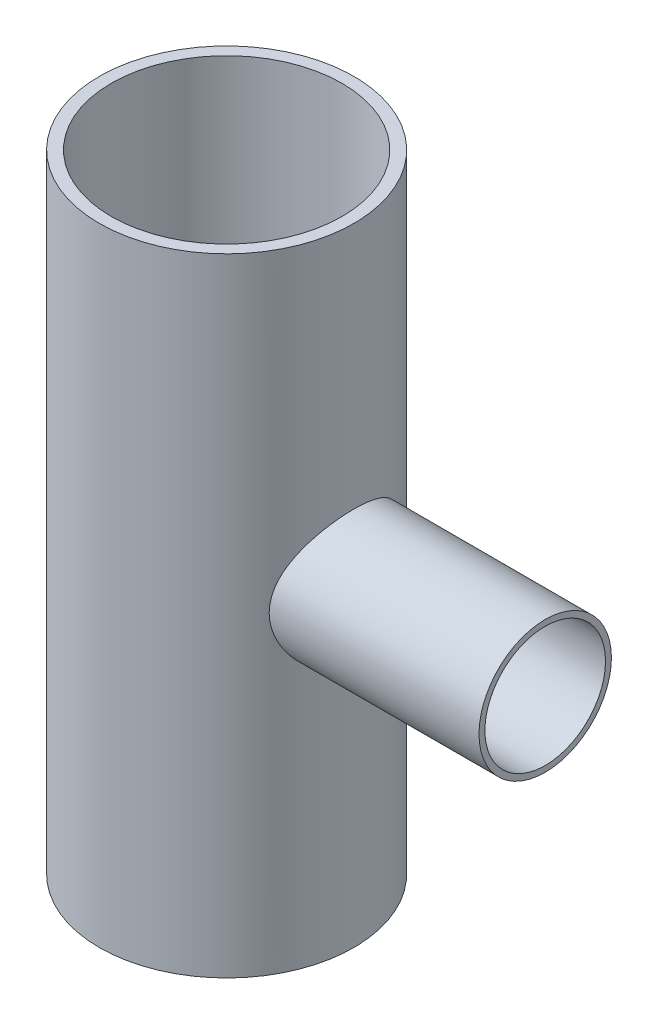
ISO-10303-21;
HEADER;
FILE_DESCRIPTION(('STEP AP214'),'2;1');
FILE_NAME('part.step','',(''),(''),'','','');
FILE_SCHEMA(('AUTOMOTIVE_DESIGN { 1 0 10303 214 1 1 1 1 }'));
ENDSEC;
DATA;
#1=APPLICATION_CONTEXT('core data for automotive mechanical design processes');
#2=APPLICATION_PROTOCOL_DEFINITION('international standard','automotive_design',2000,#1);
#3=PRODUCT_CONTEXT('',#1,'mechanical');
#4=PRODUCT('Part','Part','',(#3));
#5=PRODUCT_RELATED_PRODUCT_CATEGORY('part','',(#4));
#6=PRODUCT_DEFINITION_FORMATION('','',#4);
#7=PRODUCT_DEFINITION_CONTEXT('part definition',#1,'design');
#8=PRODUCT_DEFINITION('design','',#6,#7);
#9=PRODUCT_DEFINITION_SHAPE('','',#8);
#10=(LENGTH_UNIT() NAMED_UNIT(*) SI_UNIT(.MILLI.,.METRE.));
#11=(NAMED_UNIT(*) PLANE_ANGLE_UNIT() SI_UNIT($,.RADIAN.));
#12=(NAMED_UNIT(*) SI_UNIT($,.STERADIAN.) SOLID_ANGLE_UNIT());
#13=UNCERTAINTY_MEASURE_WITH_UNIT(LENGTH_MEASURE(1.E-05),#10,'distance_accuracy_value','');
#14=(GEOMETRIC_REPRESENTATION_CONTEXT(3) GLOBAL_UNCERTAINTY_ASSIGNED_CONTEXT((#13)) GLOBAL_UNIT_ASSIGNED_CONTEXT((#10,
#11,#12)) REPRESENTATION_CONTEXT('',''));
#15=CARTESIAN_POINT('',(0.,0.,0.));
#16=DIRECTION('',(0.,0.,1.));
#17=DIRECTION('',(1.,0.,0.));
#18=AXIS2_PLACEMENT_3D('',#15,#16,#17);
#19=CARTESIAN_POINT('',(0.,797.56,0.));
#20=DIRECTION('',(0.,-1.,0.));
#21=DIRECTION('',(0.,0.,-1.));
#22=AXIS2_PLACEMENT_3D('',#19,#20,#21);
#23=CYLINDRICAL_SURFACE('',#22,161.925);
#24=CARTESIAN_POINT('',(0.,797.56,0.));
#25=DIRECTION('',(0.,1.,0.));
#26=DIRECTION('',(0.,0.,1.));
#27=AXIS2_PLACEMENT_3D('',#24,#25,#26);
#28=CIRCLE('',#27,161.925);
#29=CARTESIAN_POINT('',(0.,797.56,161.925));
#30=VERTEX_POINT('',#29);
#31=EDGE_CURVE('E51',#30,#30,#28,.T.);
#32=ORIENTED_EDGE('',*,*,#31,.F.);
#33=EDGE_LOOP('',(#32));
#34=FACE_BOUND('',#33,.T.);
#35=CARTESIAN_POINT('',(0.,0.,0.));
#36=DIRECTION('',(0.,1.,0.));
#37=DIRECTION('',(0.,0.,1.));
#38=AXIS2_PLACEMENT_3D('',#35,#36,#37);
#39=CIRCLE('',#38,161.925);
#40=CARTESIAN_POINT('',(0.,0.,161.925));
#41=VERTEX_POINT('',#40);
#42=EDGE_CURVE('E56',#41,#41,#39,.T.);
#43=ORIENTED_EDGE('',*,*,#42,.T.);
#44=EDGE_LOOP('',(#43));
#45=FACE_BOUND('',#44,.T.);
#46=CARTESIAN_POINT('',(138.310871676814,398.78,84.201));
#47=CARTESIAN_POINT('',(138.31087186881,397.689646553853,84.2009998537785));
#48=CARTESIAN_POINT('',(138.323775964279,396.59928865279,84.1798140712417));
#49=CARTESIAN_POINT('',(138.375267290814,394.420708113961,84.095145330706));
#50=CARTESIAN_POINT('',(138.41385735769,393.332485725269,84.0316577024505));
#51=CARTESIAN_POINT('',(138.51635740774,391.160190365877,83.8625907099585));
#52=CARTESIAN_POINT('',(138.580274910478,390.076118724104,83.7569988451657));
#53=CARTESIAN_POINT('',(138.732815367061,387.914488252907,83.5040918505789));
#54=CARTESIAN_POINT('',(138.82144100952,386.836930145296,83.356772180149));
#55=CARTESIAN_POINT('',(139.022706725035,384.688832067385,83.0206664036173));
#56=CARTESIAN_POINT('',(139.135383987732,383.618305642723,82.8318160671894));
#57=CARTESIAN_POINT('',(139.383633767535,381.487813920811,82.41339339028));
#58=CARTESIAN_POINT('',(139.519208730308,380.427849764521,82.1838166997488));
#59=CARTESIAN_POINT('',(139.812001070485,378.320607200625,81.6847212547683));
#60=CARTESIAN_POINT('',(139.969214146637,377.273326316725,81.4152104376624));
#61=CARTESIAN_POINT('',(140.303936178817,375.192883673067,80.8370120636385));
#62=CARTESIAN_POINT('',(140.481447180714,374.159723348318,80.5283205572745));
#63=CARTESIAN_POINT('',(141.040069435602,371.095741671188,79.5485316630893));
#64=CARTESIAN_POINT('',(141.449057605781,369.087771653181,78.8207110718189));
#65=CARTESIAN_POINT('',(142.328943044375,365.14478755664,77.2205297815108));
#66=CARTESIAN_POINT('',(142.799841333879,363.209774682071,76.3481666984625));
#67=CARTESIAN_POINT('',(143.790421474751,359.420993100319,74.4657708646467));
#68=CARTESIAN_POINT('',(144.310102833507,357.567223573015,73.4557395040113));
#69=CARTESIAN_POINT('',(145.385007639911,353.948205788891,71.3046330700673));
#70=CARTESIAN_POINT('',(145.940232812097,352.182961834631,70.1635516362543));
#71=CARTESIAN_POINT('',(147.12401794136,348.593323770139,67.6485725269298));
#72=CARTESIAN_POINT('',(147.754689858407,346.777815221342,66.2629737889287));
#73=CARTESIAN_POINT('',(149.026444335379,343.267289450637,63.3509949282846));
#74=CARTESIAN_POINT('',(149.667527388994,341.572277963247,61.8246081133938));
#75=CARTESIAN_POINT('',(150.944661098418,338.309776048933,58.6375628526751));
#76=CARTESIAN_POINT('',(151.580709051132,336.742350412403,56.9768370300339));
#77=CARTESIAN_POINT('',(152.832382931233,333.743884890616,53.5287824181613));
#78=CARTESIAN_POINT('',(153.448008180656,332.312849530099,51.74144943217));
#79=CARTESIAN_POINT('',(154.367333121409,330.224875500059,48.9031807501698));
#80=CARTESIAN_POINT('',(154.683594622065,329.516062236012,47.894045923236));
#81=CARTESIAN_POINT('',(155.303801955514,328.141839348983,45.8430143206209));
#82=CARTESIAN_POINT('',(155.60774895809,327.476425599699,44.8011206735548));
#83=CARTESIAN_POINT('',(156.20125696383,326.190324808721,42.6858287879205));
#84=CARTESIAN_POINT('',(156.490815297487,325.569646057086,41.6124247616131));
#85=CARTESIAN_POINT('',(157.053395912716,324.374692553516,39.4360182623538));
#86=CARTESIAN_POINT('',(157.326420149153,323.800412313085,38.3330193108188));
#87=CARTESIAN_POINT('',(157.853878547534,322.699891571232,36.0995126471926));
#88=CARTESIAN_POINT('',(158.108319932503,322.173632384309,34.9690158535502));
#89=CARTESIAN_POINT('',(158.596810408814,321.170445323243,32.6821697644331));
#90=CARTESIAN_POINT('',(158.830861827899,320.693511816858,31.52582343896));
#91=CARTESIAN_POINT('',(159.276814093483,319.790377383101,29.1893231058037));
#92=CARTESIAN_POINT('',(159.488715635611,319.364174862436,28.0091698471798));
#93=CARTESIAN_POINT('',(159.888718331427,318.563884626372,25.6273584953126));
#94=CARTESIAN_POINT('',(160.076819980188,318.189795826913,24.4257008499861));
#95=CARTESIAN_POINT('',(160.414399881278,317.52140548295,22.0953600270137));
#96=CARTESIAN_POINT('',(160.565726151379,317.223202866546,20.9680619115557));
#97=CARTESIAN_POINT('',(160.845715836432,316.673343226716,18.6993990523158));
#98=CARTESIAN_POINT('',(160.974379787426,316.421685102346,17.558034641933));
#99=CARTESIAN_POINT('',(161.208128076187,315.965740063688,15.2635150887213));
#100=CARTESIAN_POINT('',(161.31321301656,315.761451938764,14.1103602480068));
#101=CARTESIAN_POINT('',(161.499047026338,315.400932879995,11.7946058009136));
#102=CARTESIAN_POINT('',(161.579796037496,315.244702061172,10.6320061719362));
#103=CARTESIAN_POINT('',(161.716326851716,314.980919584599,8.30049036796788));
#104=CARTESIAN_POINT('',(161.772122483534,314.873340964221,7.13157805580016));
#105=CARTESIAN_POINT('',(161.858398689281,314.707120583657,4.78933908223575));
#106=CARTESIAN_POINT('',(161.888879156572,314.648479029613,3.61601240226504));
#107=CARTESIAN_POINT('',(161.924296399848,314.5803480762,1.26761699301569));
#108=CARTESIAN_POINT('',(161.9292346531,314.570855834215,0.0925483684168199));
#109=CARTESIAN_POINT('',(161.913533747122,314.601051507428,-2.2567699104887));
#110=CARTESIAN_POINT('',(161.892895125546,314.640738388825,-3.43101958149153));
#111=CARTESIAN_POINT('',(161.82933653411,314.763100814478,-5.66575878562486));
#112=CARTESIAN_POINT('',(161.788695546622,314.841380561152,-6.72655720757073));
#113=CARTESIAN_POINT('',(161.686797307605,315.037953942532,-8.84354307197344));
#114=CARTESIAN_POINT('',(161.625538286583,315.156251011629,-9.89973011078612));
#115=CARTESIAN_POINT('',(161.482787798532,315.432489516786,-12.0053404095301));
#116=CARTESIAN_POINT('',(161.40129981439,315.590424128373,-13.0547648019308));
#117=CARTESIAN_POINT('',(161.218565626408,315.945515323048,-15.1453224846946));
#118=CARTESIAN_POINT('',(161.117317552159,316.142675619112,-16.1864549804637));
#119=CARTESIAN_POINT('',(160.895673667249,316.575649983692,-18.2585154206624));
#120=CARTESIAN_POINT('',(160.775279163167,316.811461414633,-19.2894440563224));
#121=CARTESIAN_POINT('',(160.516027178746,317.321139918894,-21.3395969012119));
#122=CARTESIAN_POINT('',(160.377167991925,317.595010509701,-22.3588200191625));
#123=CARTESIAN_POINT('',(160.081793260199,318.180079962933,-24.3838441458744));
#124=CARTESIAN_POINT('',(159.925278854286,318.491276417434,-25.3896460158054));
#125=CARTESIAN_POINT('',(159.59546795269,319.150248277006,-27.3864362566262));
#126=CARTESIAN_POINT('',(159.422169916828,319.498027039368,-28.3774232583532));
#127=CARTESIAN_POINT('',(158.873912984126,320.60431219953,-31.3508970282153));
#128=CARTESIAN_POINT('',(158.474320653487,321.418433887293,-33.3085309130363));
#129=CARTESIAN_POINT('',(157.618879942642,323.186270136712,-37.1464975582394));
#130=CARTESIAN_POINT('',(157.16303170301,324.139984349548,-39.0268305117696));
#131=CARTESIAN_POINT('',(156.204462221107,326.180084410531,-42.7022111611805));
#132=CARTESIAN_POINT('',(155.701729635961,327.266502383911,-44.4972380593053));
#133=CARTESIAN_POINT('',(154.659666853484,329.564653611495,-47.9939835200277));
#134=CARTESIAN_POINT('',(154.120334556788,330.776394056308,-49.6956967199974));
#135=CARTESIAN_POINT('',(152.960449154316,333.445569350282,-53.1646213109563));
#136=CARTESIAN_POINT('',(152.337168559108,334.915456391841,-54.9213523133772));
#137=CARTESIAN_POINT('',(151.074006027159,337.990013133623,-58.3062133951811));
#138=CARTESIAN_POINT('',(150.434123109864,339.594690807349,-59.9343358556913));
#139=CARTESIAN_POINT('',(149.152615459248,342.932161659988,-63.0559425217469));
#140=CARTESIAN_POINT('',(148.510989724428,344.66505944623,-64.5493145379725));
#141=CARTESIAN_POINT('',(147.242572095281,348.249919491802,-67.3925407280277));
#142=CARTESIAN_POINT('',(146.615780731517,350.10188600095,-68.7423897746473));
#143=CARTESIAN_POINT('',(145.348977418756,354.056571808043,-71.3840284524782));
#144=CARTESIAN_POINT('',(144.711332256691,356.167728987941,-72.6644133966853));
#145=CARTESIAN_POINT('',(143.798041683591,359.421840839525,-74.4464566608879));
#146=CARTESIAN_POINT('',(143.500754709482,360.521327161896,-75.017478469463));
#147=CARTESIAN_POINT('',(142.923216908793,362.748009752521,-76.1120387746762));
#148=CARTESIAN_POINT('',(142.642964017068,363.875202638375,-76.6355830311091));
#149=CARTESIAN_POINT('',(142.102346366368,366.154782627681,-77.6334375617643));
#150=CARTESIAN_POINT('',(141.841966849175,367.307150201754,-78.1077844663853));
#151=CARTESIAN_POINT('',(141.343491217351,369.635898667445,-79.0062468600813));
#152=CARTESIAN_POINT('',(141.105392425615,370.812276653389,-79.4303683855353));
#153=CARTESIAN_POINT('',(140.65397300271,373.186999772782,-80.2270225936338));
#154=CARTESIAN_POINT('',(140.440651135481,374.385343806945,-80.5995578499656));
#155=CARTESIAN_POINT('',(140.041151683929,376.801681123189,-81.2917043823596));
#156=CARTESIAN_POINT('',(139.854973438001,378.019673925543,-81.6113169483957));
#157=CARTESIAN_POINT('',(139.52577592856,380.373710134882,-82.1727486329981));
#158=CARTESIAN_POINT('',(139.380486460965,381.508436805818,-82.4187637256959));
#159=CARTESIAN_POINT('',(139.116183505046,383.790033687013,-82.8641068866674));
#160=CARTESIAN_POINT('',(138.997169246031,384.936903540061,-83.0634363243087));
#161=CARTESIAN_POINT('',(138.786688842865,387.24036773098,-83.4146423716036));
#162=CARTESIAN_POINT('',(138.695221835766,388.396961763064,-83.5665204677276));
#163=CARTESIAN_POINT('',(138.540836529534,390.717356847519,-83.8222200200366));
#164=CARTESIAN_POINT('',(138.477918284575,391.881157913563,-83.9260413850313));
#165=CARTESIAN_POINT('',(138.381373212845,394.212439285292,-84.085134468038));
#166=CARTESIAN_POINT('',(138.347725151759,395.379916306087,-84.1404413815361));
#167=CARTESIAN_POINT('',(138.310025784331,397.716648132752,-84.2023973345532));
#168=CARTESIAN_POINT('',(138.305974652173,398.885902949044,-84.2090460877103));
#169=CARTESIAN_POINT('',(138.327514639086,401.223312902656,-84.1736581979284));
#170=CARTESIAN_POINT('',(138.353103610477,402.391468113513,-84.1316250824076));
#171=CARTESIAN_POINT('',(138.433629390651,404.723984226939,-83.9990590135457));
#172=CARTESIAN_POINT('',(138.488565384215,405.888345234002,-83.9085274074235));
#173=CARTESIAN_POINT('',(138.618615839169,408.067426363677,-83.6934801151428));
#174=CARTESIAN_POINT('',(138.690408286156,409.08290035035,-83.574529043711));
#175=CARTESIAN_POINT('',(138.855464081713,411.107220560344,-83.3000083536056));
#176=CARTESIAN_POINT('',(138.948729189673,412.116066233593,-83.1444357342752));
#177=CARTESIAN_POINT('',(139.155931190259,414.125168554026,-82.7971816348821));
#178=CARTESIAN_POINT('',(139.269863990733,415.125426860499,-82.6055073025842));
#179=CARTESIAN_POINT('',(139.517502517333,417.116078708295,-82.1865640342925));
#180=CARTESIAN_POINT('',(139.651210073308,418.106471327639,-81.9592918041492));
#181=CARTESIAN_POINT('',(139.937373366362,420.076023595692,-81.4697341068109));
#182=CARTESIAN_POINT('',(140.089832416175,421.05518122607,-81.2074424522082));
#183=CARTESIAN_POINT('',(140.412326221541,423.000755203922,-80.6485475498913));
#184=CARTESIAN_POINT('',(140.582362507299,423.967170433821,-80.3519413146187));
#185=CARTESIAN_POINT('',(141.116998441872,426.845310779473,-79.4117075755721));
#186=CARTESIAN_POINT('',(141.50617619062,428.736276847199,-78.7175787130087));
#187=CARTESIAN_POINT('',(142.358251708214,432.53739112809,-77.1663862898366));
#188=CARTESIAN_POINT('',(142.82369210783,434.444520963437,-76.3033616711874));
#189=CARTESIAN_POINT('',(143.801882528926,438.179659174979,-74.4434540966626));
#190=CARTESIAN_POINT('',(144.314633175381,440.007666505487,-73.4465693723977));
#191=CARTESIAN_POINT('',(145.374939031015,443.578256042013,-71.3248858761564));
#192=CARTESIAN_POINT('',(145.922508201569,445.320803478298,-70.2000356486697));
#193=CARTESIAN_POINT('',(147.039776535762,448.713604436745,-67.8286650679139));
#194=CARTESIAN_POINT('',(147.609477204727,450.363851662199,-66.5821364296454));
#195=CARTESIAN_POINT('',(148.838542958413,453.788281297965,-63.792066117192));
#196=CARTESIAN_POINT('',(149.499391000135,455.547936990746,-62.2313046309397));
#197=CARTESIAN_POINT('',(150.816711687656,458.931576511666,-58.9671316889793));
#198=CARTESIAN_POINT('',(151.473183968195,460.555549141194,-57.2637084818647));
#199=CARTESIAN_POINT('',(152.765347315859,463.659474534588,-53.7215994787458));
#200=CARTESIAN_POINT('',(153.401029203296,465.139364235987,-51.8828550678549));
#201=CARTESIAN_POINT('',(154.63539155637,467.944979032752,-48.0790676107398));
#202=CARTESIAN_POINT('',(155.234072187781,469.270704818827,-46.1140251304362));
#203=CARTESIAN_POINT('',(156.102796134665,471.157561339698,-43.0442670446697));
#204=CARTESIAN_POINT('',(156.392095651105,471.779106847673,-41.9816463272315));
#205=CARTESIAN_POINT('',(156.954641226439,472.976642465159,-39.8269411703438));
#206=CARTESIAN_POINT('',(157.227888995845,473.552637430914,-38.7348598884437));
#207=CARTESIAN_POINT('',(157.756424143221,474.657714801283,-36.5227309341054));
#208=CARTESIAN_POINT('',(158.011708421751,475.186789114235,-35.4026784804408));
#209=CARTESIAN_POINT('',(158.502373404332,476.196405164801,-33.1367882948195));
#210=CARTESIAN_POINT('',(158.737756535501,476.676952822059,-31.990953728861));
#211=CARTESIAN_POINT('',(159.186744317134,477.587863142383,-29.6761708852834));
#212=CARTESIAN_POINT('',(159.400362647547,478.018257353429,-28.5072376846021));
#213=CARTESIAN_POINT('',(159.804326580498,478.827789521906,-26.1479439074529));
#214=CARTESIAN_POINT('',(159.994674956901,479.206933589115,-24.9575859043465));
#215=CARTESIAN_POINT('',(160.350623677809,479.912719360852,-22.5578025788232));
#216=CARTESIAN_POINT('',(160.516225054908,480.239363256045,-21.3483780543054));
#217=CARTESIAN_POINT('',(160.821353313364,480.83898548679,-18.9130579412217));
#218=CARTESIAN_POINT('',(160.960880880178,481.111965233133,-17.687162786562));
#219=CARTESIAN_POINT('',(161.20059860306,481.579589571587,-15.3403685565797));
#220=CARTESIAN_POINT('',(161.303282310175,481.779244850089,-14.2207195105913));
#221=CARTESIAN_POINT('',(161.485721493597,482.133248610726,-11.9724384390076));
#222=CARTESIAN_POINT('',(161.565477498658,482.287598137694,-10.8438066211879));
#223=CARTESIAN_POINT('',(161.701507165652,482.550477167928,-8.57986774928416));
#224=CARTESIAN_POINT('',(161.757782016301,482.659008990683,-7.44456103606296));
#225=CARTESIAN_POINT('',(161.846462318263,482.829898751089,-5.16954014695711));
#226=CARTESIAN_POINT('',(161.878867668488,482.892256493192,-4.0298259524273));
#227=CARTESIAN_POINT('',(161.919573176509,482.970569975703,-1.7487730826127));
#228=CARTESIAN_POINT('',(161.927881765289,482.986541945585,-0.60743511532373));
#229=CARTESIAN_POINT('',(161.920359054581,482.972074990911,1.67487030078295));
#230=CARTESIAN_POINT('',(161.904527692772,482.941635946538,2.81583774863651));
#231=CARTESIAN_POINT('',(161.848837777943,482.834453526536,5.09496792383115));
#232=CARTESIAN_POINT('',(161.808979987729,482.757711620961,6.23313073906376));
#233=CARTESIAN_POINT('',(161.705517635,482.558186266673,8.50431571257097));
#234=CARTESIAN_POINT('',(161.641913429389,482.435403509947,9.63733794784887));
#235=CARTESIAN_POINT('',(161.497051948433,482.155139039076,11.8111759632084));
#236=CARTESIAN_POINT('',(161.417477499765,482.00095249518,12.8525309087634));
#237=CARTESIAN_POINT('',(161.238855356961,481.653960842199,14.9271985257328));
#238=CARTESIAN_POINT('',(161.139805990259,481.461152416119,15.9605104984618));
#239=CARTESIAN_POINT('',(160.922831996758,481.037484328451,18.0171249823951));
#240=CARTESIAN_POINT('',(160.804910392818,480.806630760563,19.040429068804));
#241=CARTESIAN_POINT('',(160.550845802398,480.307437191892,21.0756582306968));
#242=CARTESIAN_POINT('',(160.414701148898,480.03909376149,22.0875822559567));
#243=CARTESIAN_POINT('',(160.124965033654,479.465615013228,24.0983994311794));
#244=CARTESIAN_POINT('',(159.971374095733,479.160480799994,25.0972929713781));
#245=CARTESIAN_POINT('',(159.647594228899,478.514153187263,27.0806486054761));
#246=CARTESIAN_POINT('',(159.477403853605,478.172956645283,28.0651094331779));
#247=CARTESIAN_POINT('',(158.943306456248,477.096453851217,30.9946518997145));
#248=CARTESIAN_POINT('',(158.555815577708,476.308121242792,32.9162894416712));
#249=CARTESIAN_POINT('',(157.709620754381,474.562798780367,36.7615577833963));
#250=CARTESIAN_POINT('',(157.24868870965,473.600325116924,38.6821953430653));
#251=CARTESIAN_POINT('',(156.27774318207,471.537568209779,42.4349976880403));
#252=CARTESIAN_POINT('',(155.767728906221,470.437282739428,44.2671610431913));
#253=CARTESIAN_POINT('',(154.709197271963,468.106165910358,47.8355034784144));
#254=CARTESIAN_POINT('',(154.160666752995,466.875289856207,49.5716493846355));
#255=CARTESIAN_POINT('',(153.036419796819,464.290327872561,52.940654829298));
#256=CARTESIAN_POINT('',(152.460701861136,462.936235147974,54.573508663012));
#257=CARTESIAN_POINT('',(151.554675425538,460.743118623925,57.024144035475));
#258=CARTESIAN_POINT('',(151.229630873027,459.944233839097,57.8801755438129));
#259=CARTESIAN_POINT('',(150.576885065102,458.312013686271,59.5576779673953));
#260=CARTESIAN_POINT('',(150.249183943503,457.478680044952,60.3791506106779));
#261=CARTESIAN_POINT('',(149.593211365436,455.778654101523,61.9865327952649));
#262=CARTESIAN_POINT('',(149.264939925086,454.91196272801,62.7724433252095));
#263=CARTESIAN_POINT('',(148.609877630591,453.146082674797,64.3079075018675));
#264=CARTESIAN_POINT('',(148.283087173873,452.246885793187,65.0574518592053));
#265=CARTESIAN_POINT('',(147.307712506436,449.500763451465,67.2510588808062));
#266=CARTESIAN_POINT('',(146.664591550281,447.606502602193,68.6389642099641));
#267=CARTESIAN_POINT('',(145.411079569549,443.701077441722,71.2560851662953));
#268=CARTESIAN_POINT('',(144.800687021113,441.689918582487,72.4853081855963));
#269=CARTESIAN_POINT('',(143.91044288665,438.546683739172,74.2289811442177));
#270=CARTESIAN_POINT('',(143.611920106369,437.45335624621,74.8044850741795));
#271=CARTESIAN_POINT('',(143.031531301988,435.239055797258,75.9083354314264));
#272=CARTESIAN_POINT('',(142.749661494907,434.118089202564,76.4366925828619));
#273=CARTESIAN_POINT('',(142.205093768045,431.849685581848,77.4451125573748));
#274=CARTESIAN_POINT('',(141.942401248916,430.702241218053,77.9251617904126));
#275=CARTESIAN_POINT('',(141.438859602608,428.382957731504,78.835431147396));
#276=CARTESIAN_POINT('',(141.198011521718,427.211117443555,79.2656488848253));
#277=CARTESIAN_POINT('',(140.741355934131,424.848589317343,80.0736607035432));
#278=CARTESIAN_POINT('',(140.525478150068,423.657965651007,80.4516025306257));
#279=CARTESIAN_POINT('',(140.120335302613,421.256904346687,81.155172981744));
#280=CARTESIAN_POINT('',(139.931069630666,420.046467162496,81.4808028020539));
#281=CARTESIAN_POINT('',(139.581426562298,417.609001814971,82.0783209788365));
#282=CARTESIAN_POINT('',(139.421032954941,416.381983380304,82.3502395012483));
#283=CARTESIAN_POINT('',(139.130958189318,413.913668049342,82.8393810248806));
#284=CARTESIAN_POINT('',(139.001272044486,412.672373505711,83.0566129069921));
#285=CARTESIAN_POINT('',(138.792762406399,410.382287878981,83.4044885143992));
#286=CARTESIAN_POINT('',(138.709090008076,409.335196602561,83.5434816882833));
#287=CARTESIAN_POINT('',(138.565114642111,407.235212875633,83.7820630907619));
#288=CARTESIAN_POINT('',(138.504805159132,406.182322125647,83.8816623055156));
#289=CARTESIAN_POINT('',(138.40807652972,404.072367678831,84.0411725168395));
#290=CARTESIAN_POINT('',(138.371659097251,403.015303688094,84.1010806660641));
#291=CARTESIAN_POINT('',(138.323053335844,400.898828234984,84.1809998166287));
#292=CARTESIAN_POINT('',(138.310871490265,399.839416220341,84.2010001420727));
#293=CARTESIAN_POINT('',(138.310871676814,398.78,84.201));
#294=B_SPLINE_CURVE_WITH_KNOTS('',3,(#46,#47,#48,#49,#50,#51,#52,#53,#54,#55,#56,#57,#58,#59,
#60,#61,#62,#63,#64,#65,#66,#67,#68,#69,#70,#71,#72,#73,#74,#75,#76,#77,#78,#79,#80,#81,#82,#83,
#84,#85,#86,#87,#88,#89,#90,#91,#92,#93,#94,#95,#96,#97,#98,#99,#100,#101,#102,#103,#104,#105,
#106,#107,#108,#109,#110,#111,#112,#113,#114,#115,#116,#117,#118,#119,#120,#121,#122,#123,#124,
#125,#126,#127,#128,#129,#130,#131,#132,#133,#134,#135,#136,#137,#138,#139,#140,#141,#142,#143,
#144,#145,#146,#147,#148,#149,#150,#151,#152,#153,#154,#155,#156,#157,#158,#159,#160,#161,#162,
#163,#164,#165,#166,#167,#168,#169,#170,#171,#172,#173,#174,#175,#176,#177,#178,#179,#180,#181,
#182,#183,#184,#185,#186,#187,#188,#189,#190,#191,#192,#193,#194,#195,#196,#197,#198,#199,#200,
#201,#202,#203,#204,#205,#206,#207,#208,#209,#210,#211,#212,#213,#214,#215,#216,#217,#218,#219,
#220,#221,#222,#223,#224,#225,#226,#227,#228,#229,#230,#231,#232,#233,#234,#235,#236,#237,#238,
#239,#240,#241,#242,#243,#244,#245,#246,#247,#248,#249,#250,#251,#252,#253,#254,#255,#256,#257,
#258,#259,#260,#261,#262,#263,#264,#265,#266,#267,#268,#269,#270,#271,#272,#273,#274,#275,#276,
#277,#278,#279,#280,#281,#282,#283,#284,#285,#286,#287,#288,#289,#290,#291,#292,#293),
.UNSPECIFIED.,.T.,.F.,(4,2,2,2,2,2,2,2,2,2,2,2,2,2,2,2,2,2,2,2,2,2,2,2,2,2,2,2,2,2,2,2,2,2,2,2,
2,2,2,2,2,2,2,2,2,2,2,2,2,2,2,2,2,2,2,2,2,2,2,2,2,2,2,2,2,2,2,2,2,2,2,2,2,2,2,2,2,2,2,2,2,2,2,2,
2,2,2,2,2,2,2,2,2,2,2,2,2,2,2,2,2,2,2,2,2,2,2,2,2,2,2,2,2,2,2,2,2,2,2,2,2,2,2,4),(0.,
3.27078668202436,6.54193452900983,9.81405428888919,13.0865302433006,16.3641033760048,
19.6420268027619,22.919299578265,26.1969029683366,32.7128638400211,39.2289321933676,
45.7449347543234,52.2612537026731,59.3617832047334,66.462650398858,73.5671013324855,
80.6717878739515,84.4900694125458,88.307987389111,92.1266110730303,95.9447823871678,
99.7614616178202,103.577704559452,107.393827613825,111.209871274135,114.736231794623,
118.262508893475,121.78869586136,125.314891268892,128.83913008747,132.363383751357,
135.887433583044,139.411409336421,142.603838712587,145.796542141003,148.988696252005,
152.181152665759,155.373391315084,158.565925192437,161.758253227272,164.950874489673,
171.415884734457,177.880878824454,184.347441088453,190.8143745895,197.928309013166,
205.042664556428,212.16288968229,219.283369085441,226.922889650326,230.744118875053,
234.564883900965,238.382783399969,242.20022357486,246.017473225409,249.834629817989,
253.343812269969,256.852891778918,260.3618613507,263.870837580915,267.377266064978,
270.883715184984,274.389910248626,277.89600792022,280.969926068817,284.044096172525,
287.117658261026,290.191504938266,293.265895438659,296.340553808958,302.488791982055,
308.915823885964,315.342940703985,321.772651091032,328.202799578425,335.524223538337,
342.846251176726,350.171469260377,357.49665452324,361.289359109979,365.081658801492,
368.874611224239,372.667100393939,376.457190950584,380.246829272825,384.036309424399,
387.825689940014,391.250367674487,394.674966423491,398.099391783773,401.523831646429,
404.947073220126,408.370323631425,411.793465364776,415.21655565076,418.382779136909,
421.549274667132,424.715263511097,427.88154217368,431.047725794113,434.214185544766,
440.545861226071,447.130735088734,453.715715358001,460.302956692507,466.890561517312,
470.535261037882,474.179778096334,477.824193773514,481.469535531205,488.765337966493,
496.060800408116,499.873003338419,503.684336911137,507.496739712684,511.309325021356,
515.11090458231,518.912397196141,522.711748664426,526.510482734671,529.688274657752,
532.865179734569,536.042312690567,539.220295459785),.UNSPECIFIED.);
#295=CARTESIAN_POINT('',(138.310871676814,398.78,84.201));
#296=VERTEX_POINT('',#295);
#297=EDGE_CURVE('E10',#296,#296,#294,.T.);
#298=ORIENTED_EDGE('',*,*,#297,.F.);
#299=EDGE_LOOP('',(#298));
#300=FACE_BOUND('',#299,.T.);
#301=ADVANCED_FACE('F37',(#34,#45,#300),#23,.T.);
#302=CARTESIAN_POINT('',(0.,797.56,0.));
#303=DIRECTION('',(0.,1.,0.));
#304=DIRECTION('',(0.,0.,1.));
#305=AXIS2_PLACEMENT_3D('',#302,#303,#304);
#306=PLANE('',#305);
#307=CARTESIAN_POINT('',(0.,797.56,0.));
#308=DIRECTION('',(0.,-1.,0.));
#309=DIRECTION('',(0.,0.,-1.));
#310=AXIS2_PLACEMENT_3D('',#307,#308,#309);
#311=CIRCLE('',#310,146.7485);
#312=CARTESIAN_POINT('',(0.,797.56,-146.7485));
#313=VERTEX_POINT('',#312);
#314=EDGE_CURVE('E93',#313,#313,#311,.T.);
#315=ORIENTED_EDGE('',*,*,#314,.T.);
#316=EDGE_LOOP('',(#315));
#317=FACE_BOUND('',#316,.T.);
#318=ORIENTED_EDGE('',*,*,#31,.T.);
#319=EDGE_LOOP('',(#318));
#320=FACE_BOUND('',#319,.T.);
#321=ADVANCED_FACE('F71',(#317,#320),#306,.T.);
#322=CARTESIAN_POINT('',(0.,0.,0.));
#323=DIRECTION('',(0.,1.,0.));
#324=DIRECTION('',(0.,0.,1.));
#325=AXIS2_PLACEMENT_3D('',#322,#323,#324);
#326=PLANE('',#325);
#327=CARTESIAN_POINT('',(0.,0.,0.));
#328=DIRECTION('',(0.,-1.,0.));
#329=DIRECTION('',(0.,0.,-1.));
#330=AXIS2_PLACEMENT_3D('',#327,#328,#329);
#331=CIRCLE('',#330,146.7485);
#332=CARTESIAN_POINT('',(0.,0.,-146.7485));
#333=VERTEX_POINT('',#332);
#334=EDGE_CURVE('E99',#333,#333,#331,.T.);
#335=ORIENTED_EDGE('',*,*,#334,.F.);
#336=EDGE_LOOP('',(#335));
#337=FACE_BOUND('',#336,.T.);
#338=ORIENTED_EDGE('',*,*,#42,.F.);
#339=EDGE_LOOP('',(#338));
#340=FACE_BOUND('',#339,.T.);
#341=ADVANCED_FACE('F69',(#337,#340),#326,.F.);
#342=CARTESIAN_POINT('',(405.13,398.78,0.));
#343=DIRECTION('',(-1.,0.,0.));
#344=DIRECTION('',(0.,0.,1.));
#345=AXIS2_PLACEMENT_3D('',#342,#343,#344);
#346=CYLINDRICAL_SURFACE('',#345,84.201);
#347=CARTESIAN_POINT('',(405.13,398.78,0.));
#348=DIRECTION('',(1.,0.,0.));
#349=DIRECTION('',(0.,0.,-1.));
#350=AXIS2_PLACEMENT_3D('',#347,#348,#349);
#351=CIRCLE('',#350,84.201);
#352=CARTESIAN_POINT('',(405.13,398.78,-84.201));
#353=VERTEX_POINT('',#352);
#354=EDGE_CURVE('E90',#353,#353,#351,.T.);
#355=ORIENTED_EDGE('',*,*,#354,.F.);
#356=EDGE_LOOP('',(#355));
#357=FACE_BOUND('',#356,.T.);
#358=ORIENTED_EDGE('',*,*,#297,.T.);
#359=EDGE_LOOP('',(#358));
#360=FACE_BOUND('',#359,.T.);
#361=ADVANCED_FACE('F63',(#357,#360),#346,.T.);
#362=CARTESIAN_POINT('',(405.13,398.78,0.));
#363=DIRECTION('',(1.,0.,0.));
#364=DIRECTION('',(0.,0.,-1.));
#365=AXIS2_PLACEMENT_3D('',#362,#363,#364);
#366=PLANE('',#365);
#367=CARTESIAN_POINT('',(405.13,398.78,0.));
#368=DIRECTION('',(1.,0.,0.));
#369=DIRECTION('',(0.,0.,-1.));
#370=AXIS2_PLACEMENT_3D('',#367,#368,#369);
#371=CIRCLE('',#370,76.6953);
#372=CARTESIAN_POINT('',(405.13,398.78,-76.6953));
#373=VERTEX_POINT('',#372);
#374=EDGE_CURVE('E105',#373,#373,#371,.T.);
#375=ORIENTED_EDGE('',*,*,#374,.F.);
#376=EDGE_LOOP('',(#375));
#377=FACE_BOUND('',#376,.T.);
#378=ORIENTED_EDGE('',*,*,#354,.T.);
#379=EDGE_LOOP('',(#378));
#380=FACE_BOUND('',#379,.T.);
#381=ADVANCED_FACE('F68',(#377,#380),#366,.T.);
#382=CARTESIAN_POINT('',(0.,797.56,0.));
#383=DIRECTION('',(0.,-1.,0.));
#384=DIRECTION('',(0.,0.,-1.));
#385=AXIS2_PLACEMENT_3D('',#382,#383,#384);
#386=CYLINDRICAL_SURFACE('',#385,146.7485);
#387=CARTESIAN_POINT('',(125.111762876877,398.78,-76.6953));
#388=CARTESIAN_POINT('',(125.111762928609,399.772295587023,-76.6952999645415));
#389=CARTESIAN_POINT('',(125.123578005198,400.764592435153,-76.6760361795435));
#390=CARTESIAN_POINT('',(125.170723031049,402.747238424881,-76.5990494599259));
#391=CARTESIAN_POINT('',(125.206055533083,403.737587343329,-76.5413223501859));
#392=CARTESIAN_POINT('',(125.299901377919,405.714494364595,-76.3875976129726));
#393=CARTESIAN_POINT('',(125.358421456935,406.701051281633,-76.2915888642666));
#394=CARTESIAN_POINT('',(125.498077865254,408.66822752329,-76.0616380684884));
#395=CARTESIAN_POINT('',(125.57921665828,409.648846189195,-75.9276918890927));
#396=CARTESIAN_POINT('',(125.763473361906,411.603662927013,-75.6221058093696));
#397=CARTESIAN_POINT('',(125.866624844196,412.577848821937,-75.4504083220228));
#398=CARTESIAN_POINT('',(126.093880613528,414.516596659442,-75.0699979307181));
#399=CARTESIAN_POINT('',(126.217987142342,415.481157560636,-74.8612810663051));
#400=CARTESIAN_POINT('',(126.486003521483,417.398724329813,-74.4075439162883));
#401=CARTESIAN_POINT('',(126.629909474179,418.351732431953,-74.1625307750894));
#402=CARTESIAN_POINT('',(126.936289346361,420.244889550919,-73.6369002951099));
#403=CARTESIAN_POINT('',(127.098765139543,421.185037259397,-73.3562793631888));
#404=CARTESIAN_POINT('',(127.610038251434,423.973073048891,-72.4656356268137));
#405=CARTESIAN_POINT('',(127.984331167441,425.800157474609,-71.8040740035288));
#406=CARTESIAN_POINT('',(128.789521526121,429.387948398149,-70.349637105055));
#407=CARTESIAN_POINT('',(129.220419869151,431.148653839584,-69.556759741127));
#408=CARTESIAN_POINT('',(130.126814986513,434.596208018742,-67.8459359446676));
#409=CARTESIAN_POINT('',(130.602311646676,436.283056945516,-66.9279898323011));
#410=CARTESIAN_POINT('',(131.585797484785,439.576315525561,-64.9730504936296));
#411=CARTESIAN_POINT('',(132.093788254949,441.18272123021,-63.9360514317236));
#412=CARTESIAN_POINT('',(133.177364302527,444.451051560784,-61.6494437015444));
#413=CARTESIAN_POINT('',(133.754903337326,446.104815103557,-60.3890841259385));
#414=CARTESIAN_POINT('',(134.919546482165,449.302755868865,-57.7402053122674));
#415=CARTESIAN_POINT('',(135.506651049118,450.846927837612,-56.3516799373021));
#416=CARTESIAN_POINT('',(136.676308813929,453.819331548897,-53.4523517285595));
#417=CARTESIAN_POINT('',(137.258859541391,455.247503840307,-51.9414869767397));
#418=CARTESIAN_POINT('',(138.405340443902,457.979856780097,-48.804420411003));
#419=CARTESIAN_POINT('',(138.969269991313,459.284033251893,-47.1782147152465));
#420=CARTESIAN_POINT('',(139.811749069129,461.187755506942,-44.5948591542731));
#421=CARTESIAN_POINT('',(140.101755759279,461.834427373302,-43.6757837161463));
#422=CARTESIAN_POINT('',(140.670503360016,463.088238468352,-41.8077089484317));
#423=CARTESIAN_POINT('',(140.949245340396,463.69538145441,-40.8587124757138));
#424=CARTESIAN_POINT('',(141.493565859938,464.868926711829,-38.9319349106069));
#425=CARTESIAN_POINT('',(141.759141942369,465.435321388464,-37.9541484999227));
#426=CARTESIAN_POINT('',(142.275158627428,466.525835822083,-35.9715243672063));
#427=CARTESIAN_POINT('',(142.525601023141,467.049960589807,-34.9666898703879));
#428=CARTESIAN_POINT('',(143.009465102771,468.054436413176,-32.931874338675));
#429=CARTESIAN_POINT('',(143.242893476332,468.534804691939,-31.9019034019848));
#430=CARTESIAN_POINT('',(143.691076795555,469.4505863716,-29.8183178633066));
#431=CARTESIAN_POINT('',(143.905833880396,469.886004923489,-28.7647059873224));
#432=CARTESIAN_POINT('',(144.315060341043,470.710602366867,-26.6357014411474));
#433=CARTESIAN_POINT('',(144.509530371331,471.099782750104,-25.5603094749422));
#434=CARTESIAN_POINT('',(144.876667575449,471.830636254079,-23.3898432001147));
#435=CARTESIAN_POINT('',(145.049335208076,472.172310374527,-22.2947693062214));
#436=CARTESIAN_POINT('',(145.359155500572,472.782666063067,-20.1717446710138));
#437=CARTESIAN_POINT('',(145.498014984346,473.054932961651,-19.1450723269255));
#438=CARTESIAN_POINT('',(145.754995985789,473.55708332303,-17.0788508431723));
#439=CARTESIAN_POINT('',(145.873117851188,473.786967496507,-16.0393019197367));
#440=CARTESIAN_POINT('',(146.087780211005,474.203591754724,-13.9494128197347));
#441=CARTESIAN_POINT('',(146.184321336883,474.390333101844,-12.8990729598559));
#442=CARTESIAN_POINT('',(146.355127719362,474.72004272577,-10.7897377926675));
#443=CARTESIAN_POINT('',(146.429392922276,474.86301089708,-9.7307424645037));
#444=CARTESIAN_POINT('',(146.555066367962,475.10460224922,-7.60695126235324));
#445=CARTESIAN_POINT('',(146.606487304562,475.203250057805,-6.54215894339201));
#446=CARTESIAN_POINT('',(146.686150915259,475.355961682984,-4.40852026191594));
#447=CARTESIAN_POINT('',(146.714393721436,475.410025753638,-3.33967392253776));
#448=CARTESIAN_POINT('',(146.74748996141,475.473372115193,-1.20035188335691));
#449=CARTESIAN_POINT('',(146.752344649454,475.4826568075,-0.129876274007752));
#450=CARTESIAN_POINT('',(146.738630998963,475.456415905888,2.01036077093598));
#451=CARTESIAN_POINT('',(146.720063158937,475.420891265662,3.0801222212454));
#452=CARTESIAN_POINT('',(146.662517373389,475.310665335643,5.11504286768073));
#453=CARTESIAN_POINT('',(146.62564618446,475.240006863,6.08048376664628));
#454=CARTESIAN_POINT('',(146.533059290389,475.062304744005,8.00718507211638));
#455=CARTESIAN_POINT('',(146.477342103734,474.955258237129,8.9684451439405));
#456=CARTESIAN_POINT('',(146.347411392806,474.705114608142,10.8848354090329));
#457=CARTESIAN_POINT('',(146.273201001272,474.562023591906,11.839966612447));
#458=CARTESIAN_POINT('',(146.106716431833,474.240177124517,13.742701169262));
#459=CARTESIAN_POINT('',(146.014440543286,474.061418295903,14.6903038009242));
#460=CARTESIAN_POINT('',(145.81237667628,473.668746540918,16.5762559976945));
#461=CARTESIAN_POINT('',(145.702589891826,473.454836011382,17.5146061890635));
#462=CARTESIAN_POINT('',(145.466142820633,472.99243029675,19.3806252064049));
#463=CARTESIAN_POINT('',(145.339480973604,472.743931913523,20.308293036045));
#464=CARTESIAN_POINT('',(144.935250048347,471.947506545617,23.072962364147));
#465=CARTESIAN_POINT('',(144.63339025057,471.34856188857,24.8920485038473));
#466=CARTESIAN_POINT('',(143.967517330285,470.012241510516,28.4933964132372));
#467=CARTESIAN_POINT('',(143.602769557164,469.273217908307,30.2749062431874));
#468=CARTESIAN_POINT('',(142.82173234635,467.668210015335,33.7679990495142));
#469=CARTESIAN_POINT('',(142.40544304694,466.802226065199,35.4795822134842));
#470=CARTESIAN_POINT('',(141.529919510138,464.949715828256,38.8251881574171));
#471=CARTESIAN_POINT('',(141.070674991304,463.963160665008,40.4591922268062));
#472=CARTESIAN_POINT('',(140.118582577169,461.876166318193,43.6424750405722));
#473=CARTESIAN_POINT('',(139.625732745714,460.775720570984,45.1917488939778));
#474=CARTESIAN_POINT('',(138.565252586144,458.350814578016,48.3512367417379));
#475=CARTESIAN_POINT('',(137.995090948811,457.014955003505,49.9518631964556));
#476=CARTESIAN_POINT('',(136.839300090538,454.220590551981,53.0362259746375));
#477=CARTESIAN_POINT('',(136.253669951649,452.762078385125,54.5199553401699));
#478=CARTESIAN_POINT('',(135.080488120511,449.728434321096,57.3650913544329));
#479=CARTESIAN_POINT('',(134.492935229277,448.153205723323,58.7263944575234));
#480=CARTESIAN_POINT('',(133.331043592834,444.894336875067,61.3186195037421));
#481=CARTESIAN_POINT('',(132.756705330918,443.210692668083,62.5495366842495));
#482=CARTESIAN_POINT('',(131.594761454243,439.613013908262,64.960463497952));
#483=CARTESIAN_POINT('',(131.009330572514,437.691153141026,66.1299283123193));
#484=CARTESIAN_POINT('',(130.1704600575,434.728484254144,67.7580014295311));
#485=CARTESIAN_POINT('',(129.897333648681,433.727414281502,68.2797602156614));
#486=CARTESIAN_POINT('',(129.366603125926,431.699927432429,69.2800453132862));
#487=CARTESIAN_POINT('',(129.108997127969,430.673513653892,69.7585768756662));
#488=CARTESIAN_POINT('',(128.611932147079,428.597624289491,70.6708061701979));
#489=CARTESIAN_POINT('',(128.372459623917,427.548166681074,71.1045374445274));
#490=CARTESIAN_POINT('',(127.913867482415,425.427251940925,71.9262548603059));
#491=CARTESIAN_POINT('',(127.694745413999,424.355797476501,72.3142465100596));
#492=CARTESIAN_POINT('',(127.279155539658,422.192745329105,73.0432398543044));
#493=CARTESIAN_POINT('',(127.0826865859,421.101148669992,73.3842439298283));
#494=CARTESIAN_POINT('',(126.714588627176,418.89991711475,74.0180359148884));
#495=CARTESIAN_POINT('',(126.542959012991,417.790282661765,74.3108250069879));
#496=CARTESIAN_POINT('',(126.23933576432,415.645665913422,74.8253580404902));
#497=CARTESIAN_POINT('',(126.105260103419,414.611895663453,75.0509308102443));
#498=CARTESIAN_POINT('',(125.861184898052,412.533177701789,75.4595326211651));
#499=CARTESIAN_POINT('',(125.75118463868,411.488230322961,75.6425629256161));
#500=CARTESIAN_POINT('',(125.556441753416,409.38936477873,75.9653719822985));
#501=CARTESIAN_POINT('',(125.471698340815,408.335446893795,76.1051520817054));
#502=CARTESIAN_POINT('',(125.328401400154,406.220940646884,76.3409006022752));
#503=CARTESIAN_POINT('',(125.26984792035,405.160352272621,76.4368689427143));
#504=CARTESIAN_POINT('',(125.179626976278,403.035748328994,76.5845332629556));
#505=CARTESIAN_POINT('',(125.147939529895,401.971735898654,76.6362621469317));
#506=CARTESIAN_POINT('',(125.111739967931,399.842008535224,76.6953452491011));
#507=CARTESIAN_POINT('',(125.107228015765,398.776293591935,76.7026992004522));
#508=CARTESIAN_POINT('',(125.125430704859,396.645798609844,76.6730013476121));
#509=CARTESIAN_POINT('',(125.148143325605,395.58101850753,76.6359528388188));
#510=CARTESIAN_POINT('',(125.220531746314,393.454861794736,76.5176156855282));
#511=CARTESIAN_POINT('',(125.270206781933,392.393485088633,76.4363282951384));
#512=CARTESIAN_POINT('',(125.388081377316,390.409076035609,76.2427856894246));
#513=CARTESIAN_POINT('',(125.453185033942,389.485351765445,76.1356784716332));
#514=CARTESIAN_POINT('',(125.603040770872,387.64389507376,75.8882028551131));
#515=CARTESIAN_POINT('',(125.687794458235,386.726163148632,75.7478317359096));
#516=CARTESIAN_POINT('',(125.876226205742,384.898462322245,75.434285316545));
#517=CARTESIAN_POINT('',(125.97990048923,383.988491909619,75.2611165627134));
#518=CARTESIAN_POINT('',(126.205337919308,382.177533658488,74.8824631794678));
#519=CARTESIAN_POINT('',(126.327102741249,381.276546660185,74.6769755569231));
#520=CARTESIAN_POINT('',(126.718187181656,378.588777870645,74.0127607181748));
#521=CARTESIAN_POINT('',(127.013291115188,376.817242309826,73.5062908323525));
#522=CARTESIAN_POINT('',(127.663421542778,373.325301728417,72.3712641194776));
#523=CARTESIAN_POINT('',(128.018451916632,371.604900026854,71.7426993872864));
#524=CARTESIAN_POINT('',(128.795959080372,368.146498781596,70.3377304732002));
#525=CARTESIAN_POINT('',(129.220757533478,366.411212531863,69.5559321817496));
#526=CARTESIAN_POINT('',(130.113725787363,363.012443284794,67.8708292939819));
#527=CARTESIAN_POINT('',(130.581896147128,361.348961213289,66.9675231315831));
#528=CARTESIAN_POINT('',(131.550213095735,358.099388848394,65.0447729351841));
#529=CARTESIAN_POINT('',(132.05037245739,356.513329920441,64.0252823815579));
#530=CARTESIAN_POINT('',(133.071110303351,353.424824740285,61.8758232044088));
#531=CARTESIAN_POINT('',(133.591690188143,351.922384239977,60.7458469955672));
#532=CARTESIAN_POINT('',(134.715917047826,348.801693818003,58.2144392657896));
#533=CARTESIAN_POINT('',(135.320971386067,347.196769077179,56.7971649790249));
#534=CARTESIAN_POINT('',(136.527401809865,344.110112527723,53.8326275712129));
#535=CARTESIAN_POINT('',(137.128777585351,342.628390975015,52.28535364999));
#536=CARTESIAN_POINT('',(138.312858505425,339.795680435794,49.0674663280169));
#537=CARTESIAN_POINT('',(138.895555176257,338.444750236578,47.3967980540126));
#538=CARTESIAN_POINT('',(140.027440354905,335.882849010073,43.9402238645012));
#539=CARTESIAN_POINT('',(140.576628986849,334.671877464296,42.1543183759366));
#540=CARTESIAN_POINT('',(141.374222408565,332.946957364186,39.3628677309477));
#541=CARTESIAN_POINT('',(141.640102510902,332.37820210167,38.3957385408453));
#542=CARTESIAN_POINT('',(142.157230037197,331.282159658548,36.4344896273882));
#543=CARTESIAN_POINT('',(142.40847901878,330.754868061633,35.4403727937106));
#544=CARTESIAN_POINT('',(142.89459203298,329.742994530101,33.4265035513097));
#545=CARTESIAN_POINT('',(143.129453216455,329.25842001834,32.4067467265929));
#546=CARTESIAN_POINT('',(143.581002907016,328.333466434727,30.3435788383701));
#547=CARTESIAN_POINT('',(143.797693634967,327.893081960503,29.3001706854809));
#548=CARTESIAN_POINT('',(144.211175128456,327.058027552993,27.1921343046593));
#549=CARTESIAN_POINT('',(144.407978514731,326.66332860372,26.1275200545153));
#550=CARTESIAN_POINT('',(144.780309490343,325.920628276513,23.9785982318008));
#551=CARTESIAN_POINT('',(144.955839624375,325.572621312776,22.8942930325282));
#552=CARTESIAN_POINT('',(145.284262732768,324.924452782683,20.7081380094762));
#553=CARTESIAN_POINT('',(145.437156673948,324.624289172838,19.6062889372444));
#554=CARTESIAN_POINT('',(145.719081775597,324.072880182818,17.3874108090371));
#555=CARTESIAN_POINT('',(145.848113569385,323.821633504339,16.2703821567845));
#556=CARTESIAN_POINT('',(146.069971741083,323.390915388501,14.1324532299479));
#557=CARTESIAN_POINT('',(146.165093666184,323.206850510625,13.1127137182917));
#558=CARTESIAN_POINT('',(146.334361337822,322.879989038423,11.0649170871073));
#559=CARTESIAN_POINT('',(146.408507432755,322.737191758669,10.0368601060188));
#560=CARTESIAN_POINT('',(146.535306912892,322.493344503235,7.97454310493182));
#561=CARTESIAN_POINT('',(146.587961458268,322.392292274042,6.94028342283103));
#562=CARTESIAN_POINT('',(146.671415635173,322.232265749309,4.8676273054483));
#563=CARTESIAN_POINT('',(146.702215173932,322.173291632382,3.82923085262557));
#564=CARTESIAN_POINT('',(146.741734740633,322.09763863138,1.75084692101196));
#565=CARTESIAN_POINT('',(146.750462597668,322.080944749988,0.710860137344973));
#566=CARTESIAN_POINT('',(146.745799760216,322.089866656398,-1.36888061766372));
#567=CARTESIAN_POINT('',(146.732409109645,322.115482360193,-2.40863458946357));
#568=CARTESIAN_POINT('',(146.683604921709,322.208932838472,-4.48569053729593));
#569=CARTESIAN_POINT('',(146.648192053184,322.276766330754,-5.52299258683572));
#570=CARTESIAN_POINT('',(146.555593015813,322.454418525811,-7.59300643018613));
#571=CARTESIAN_POINT('',(146.498407180935,322.5642365846,-8.62571829415812));
#572=CARTESIAN_POINT('',(146.367840424829,322.815520858419,-10.6059273727217));
#573=CARTESIAN_POINT('',(146.29602708252,322.953934982116,-11.5539173102363));
#574=CARTESIAN_POINT('',(146.134581154471,323.265892581028,-13.4426499570154));
#575=CARTESIAN_POINT('',(146.044947162944,323.439438827667,-14.3833920884499));
#576=CARTESIAN_POINT('',(145.848400091708,323.821148895087,-16.2558448063597));
#577=CARTESIAN_POINT('',(145.741489736283,324.029307258082,-17.1875567922724));
#578=CARTESIAN_POINT('',(145.51098250534,324.47972915491,-19.0406976807093));
#579=CARTESIAN_POINT('',(145.387384102124,324.721995811254,-19.9621256334168));
#580=CARTESIAN_POINT('',(145.12420350515,325.240003886496,-21.7931911008712));
#581=CARTESIAN_POINT('',(144.984621810015,325.51574426115,-22.7028289824413));
#582=CARTESIAN_POINT('',(144.69024525047,326.100034319002,-24.5090381970421));
#583=CARTESIAN_POINT('',(144.535449058934,326.408586864528,-25.4056083823595));
#584=CARTESIAN_POINT('',(144.049485910465,327.382390052299,-28.0737197634692));
#585=CARTESIAN_POINT('',(143.696692035824,328.095888560827,-29.8240225668899));
#586=CARTESIAN_POINT('',(142.925998643659,329.675862035068,-33.3260143455629));
#587=CARTESIAN_POINT('',(142.506075645851,330.547272183867,-35.0750188669117));
#588=CARTESIAN_POINT('',(141.621112398417,332.415379605633,-38.492841120016));
#589=CARTESIAN_POINT('',(141.156071436881,333.41207885559,-40.1616575858761));
#590=CARTESIAN_POINT('',(140.190487380902,335.524154607759,-43.4122788490938));
#591=CARTESIAN_POINT('',(139.689932276309,336.639571322157,-44.9940538866463));
#592=CARTESIAN_POINT('',(138.663604407264,338.982417608254,-48.0639797520469));
#593=CARTESIAN_POINT('',(138.137830243995,340.209853396701,-49.5521253759702));
#594=CARTESIAN_POINT('',(137.309836517271,342.198617364138,-51.7866098647641));
#595=CARTESIAN_POINT('',(137.012574233361,342.923473781131,-52.5675930610883));
#596=CARTESIAN_POINT('',(136.415477092736,344.404559841865,-54.0981922547257));
#597=CARTESIAN_POINT('',(136.115642364369,345.160787927501,-54.8478098061391));
#598=CARTESIAN_POINT('',(135.515301262267,346.703627042395,-56.314771458907));
#599=CARTESIAN_POINT('',(135.21479490717,347.49023723812,-57.0321164444911));
#600=CARTESIAN_POINT('',(134.614979800702,349.093060110878,-58.4338165844007));
#601=CARTESIAN_POINT('',(134.31567137121,349.909280219437,-59.1181633550052));
#602=CARTESIAN_POINT('',(133.422060123362,352.402183848605,-61.1213090717596));
#603=CARTESIAN_POINT('',(132.832508415386,354.12199928477,-62.3891565513544));
#604=CARTESIAN_POINT('',(131.682640253712,357.668244770666,-64.7809072751174));
#605=CARTESIAN_POINT('',(131.122322485453,359.49467001864,-65.9048169950397));
#606=CARTESIAN_POINT('',(130.303947852634,362.351299464014,-67.5009880421932));
#607=CARTESIAN_POINT('',(130.029096820152,363.34616117487,-68.0285523422225));
#608=CARTESIAN_POINT('',(129.494491634979,365.361241749003,-69.0407587540835));
#609=CARTESIAN_POINT('',(129.234734063797,366.381454795184,-69.525410598205));
#610=CARTESIAN_POINT('',(128.732632612955,368.446181711375,-70.4507542979293));
#611=CARTESIAN_POINT('',(128.490293642253,369.490702322873,-70.8914337745996));
#612=CARTESIAN_POINT('',(128.025494426668,371.602168407385,-71.7274271112976));
#613=CARTESIAN_POINT('',(127.803035132573,372.669114949957,-72.122738801769));
#614=CARTESIAN_POINT('',(127.380949214135,374.820404365345,-72.8656163968692));
#615=CARTESIAN_POINT('',(127.181258716224,375.904688330034,-73.2133164474575));
#616=CARTESIAN_POINT('',(126.806173358821,378.091533006715,-73.861063908003));
#617=CARTESIAN_POINT('',(126.630777936205,379.194093294426,-74.1611124224759));
#618=CARTESIAN_POINT('',(126.306396687297,381.414567537732,-74.7122387941683));
#619=CARTESIAN_POINT('',(126.157396123711,382.53247254766,-74.9633439862876));
#620=CARTESIAN_POINT('',(125.887507107242,384.781529301632,-75.4156963228566));
#621=CARTESIAN_POINT('',(125.766614125063,385.912678880527,-75.6169515005538));
#622=CARTESIAN_POINT('',(125.570222429673,388.016391261985,-75.9425568621575));
#623=CARTESIAN_POINT('',(125.490645407045,388.987499175087,-76.0738951286965));
#624=CARTESIAN_POINT('',(125.35369435522,390.935325590749,-76.2993512705059));
#625=CARTESIAN_POINT('',(125.296314126764,391.912042449358,-76.3934795381793));
#626=CARTESIAN_POINT('',(125.20427438483,393.869502472781,-76.5442338105732));
#627=CARTESIAN_POINT('',(125.169616448851,394.850245912386,-76.6008572115147));
#628=CARTESIAN_POINT('',(125.123357582827,396.813992132532,-76.6763953714894));
#629=CARTESIAN_POINT('',(125.11176282563,397.796995447465,-76.6953000351265));
#630=CARTESIAN_POINT('',(125.111762876877,398.78,-76.6953));
#631=B_SPLINE_CURVE_WITH_KNOTS('',3,(#387,#388,#389,#390,#391,#392,#393,#394,#395,#396,#397,
#398,#399,#400,#401,#402,#403,#404,#405,#406,#407,#408,#409,#410,#411,#412,#413,#414,#415,#416,
#417,#418,#419,#420,#421,#422,#423,#424,#425,#426,#427,#428,#429,#430,#431,#432,#433,#434,#435,
#436,#437,#438,#439,#440,#441,#442,#443,#444,#445,#446,#447,#448,#449,#450,#451,#452,#453,#454,
#455,#456,#457,#458,#459,#460,#461,#462,#463,#464,#465,#466,#467,#468,#469,#470,#471,#472,#473,
#474,#475,#476,#477,#478,#479,#480,#481,#482,#483,#484,#485,#486,#487,#488,#489,#490,#491,#492,
#493,#494,#495,#496,#497,#498,#499,#500,#501,#502,#503,#504,#505,#506,#507,#508,#509,#510,#511,
#512,#513,#514,#515,#516,#517,#518,#519,#520,#521,#522,#523,#524,#525,#526,#527,#528,#529,#530,
#531,#532,#533,#534,#535,#536,#537,#538,#539,#540,#541,#542,#543,#544,#545,#546,#547,#548,#549,
#550,#551,#552,#553,#554,#555,#556,#557,#558,#559,#560,#561,#562,#563,#564,#565,#566,#567,#568,
#569,#570,#571,#572,#573,#574,#575,#576,#577,#578,#579,#580,#581,#582,#583,#584,#585,#586,#587,
#588,#589,#590,#591,#592,#593,#594,#595,#596,#597,#598,#599,#600,#601,#602,#603,#604,#605,#606,
#607,#608,#609,#610,#611,#612,#613,#614,#615,#616,#617,#618,#619,#620,#621,#622,#623,#624,#625,
#626,#627,#628,#629,#630),.UNSPECIFIED.,.T.,.F.,(4,2,2,2,2,2,2,2,2,2,2,2,2,2,2,2,2,2,2,2,2,2,2,
2,2,2,2,2,2,2,2,2,2,2,2,2,2,2,2,2,2,2,2,2,2,2,2,2,2,2,2,2,2,2,2,2,2,2,2,2,2,2,2,2,2,2,2,2,2,2,2,
2,2,2,2,2,2,2,2,2,2,2,2,2,2,2,2,2,2,2,2,2,2,2,2,2,2,2,2,2,2,2,2,2,2,2,2,2,2,2,2,2,2,2,2,2,2,2,2,
2,2,4),(0.,2.97663236440583,5.95358788921723,8.93140888283645,11.9095543595628,14.8922747057111,
17.8753143458,20.8577675952941,23.8405220403532,29.7700230972588,35.6996184792602,
41.6291986823022,47.5590696589072,54.0263163449875,60.4938728598732,66.9647234242265,
73.4357918707325,76.9166494295436,80.3971756354824,83.8783488750044,87.3591088423107,
90.8384927631909,94.3174775222458,97.7963500109178,101.275149280075,104.487658635499,
107.700114117951,110.912475590459,114.124844804982,117.335426769164,120.545990437756,
123.756381929877,126.96670509532,129.872017812749,132.77755897445,135.68260827333,
138.587932788027,141.49305928402,144.398454578369,150.207958368269,156.090602477358,
161.97323080395,167.857270773302,173.741650035565,180.218909966164,186.696555144486,
193.179628447435,199.662938476706,206.627046140624,210.110443487132,213.593417128762,
217.073763856379,220.553691025758,224.033441789557,227.513107193197,230.71163106402,
233.910059943616,237.108389187169,240.306724323659,243.502678546433,246.69865198759,
249.894388249265,253.090033921226,255.885793820142,258.681782448113,261.47721359046,
264.272903777244,269.864448996883,275.456356366791,281.300769160866,287.145257289199,
292.992093796762,298.839331997192,305.50691990664,312.175062298126,318.846188064844,
325.517289117121,328.975466136664,332.433274324289,335.891682188207,339.349666734296,
342.805442837249,346.260805153331,349.716019844123,353.171142817635,356.291833953178,
359.412473252983,362.532944069986,365.653428132557,368.772805166185,371.892176006244,
375.011452112093,378.130680374441,381.012039744337,383.893626501161,386.774759307321,
389.656156044174,392.537462916189,395.419021341769,401.18100548799,407.170937012608,
413.160963066736,419.153024569222,425.145418816953,428.463308528841,431.78103365131,
435.098667816667,438.417140485738,445.058856062506,451.700272723697,455.176717827993,
458.652372464825,462.129002810382,465.605799344454,469.072589053377,472.539298393803,
476.00406599017,479.468274881188,482.416867076118,485.364635174146,488.312607899811,
491.261369542711),.UNSPECIFIED.);
#632=CARTESIAN_POINT('',(125.111762876877,398.78,-76.6953));
#633=VERTEX_POINT('',#632);
#634=EDGE_CURVE('E41',#633,#633,#631,.T.);
#635=ORIENTED_EDGE('',*,*,#634,.T.);
#636=EDGE_LOOP('',(#635));
#637=FACE_BOUND('',#636,.T.);
#638=ORIENTED_EDGE('',*,*,#314,.F.);
#639=EDGE_LOOP('',(#638));
#640=FACE_BOUND('',#639,.T.);
#641=ORIENTED_EDGE('',*,*,#334,.T.);
#642=EDGE_LOOP('',(#641));
#643=FACE_BOUND('',#642,.T.);
#644=ADVANCED_FACE('F114',(#637,#640,#643),#386,.F.);
#645=CARTESIAN_POINT('',(-216.927066860547,398.78,0.));
#646=DIRECTION('',(1.,0.,0.));
#647=DIRECTION('',(0.,0.,-1.));
#648=AXIS2_PLACEMENT_3D('',#645,#646,#647);
#649=CYLINDRICAL_SURFACE('',#648,76.6953);
#650=ORIENTED_EDGE('',*,*,#374,.T.);
#651=EDGE_LOOP('',(#650));
#652=FACE_BOUND('',#651,.T.);
#653=ORIENTED_EDGE('',*,*,#634,.F.);
#654=EDGE_LOOP('',(#653));
#655=FACE_BOUND('',#654,.T.);
#656=ADVANCED_FACE('F117',(#652,#655),#649,.F.);
#657=CLOSED_SHELL('',(#301,#321,#341,#361,#381,#644,#656));
#658=MANIFOLD_SOLID_BREP('B2',#657);
#659=ADVANCED_BREP_SHAPE_REPRESENTATION('',(#18,#658),#14);
#660=SHAPE_DEFINITION_REPRESENTATION(#9,#659);
ENDSEC;
END-ISO-10303-21;
